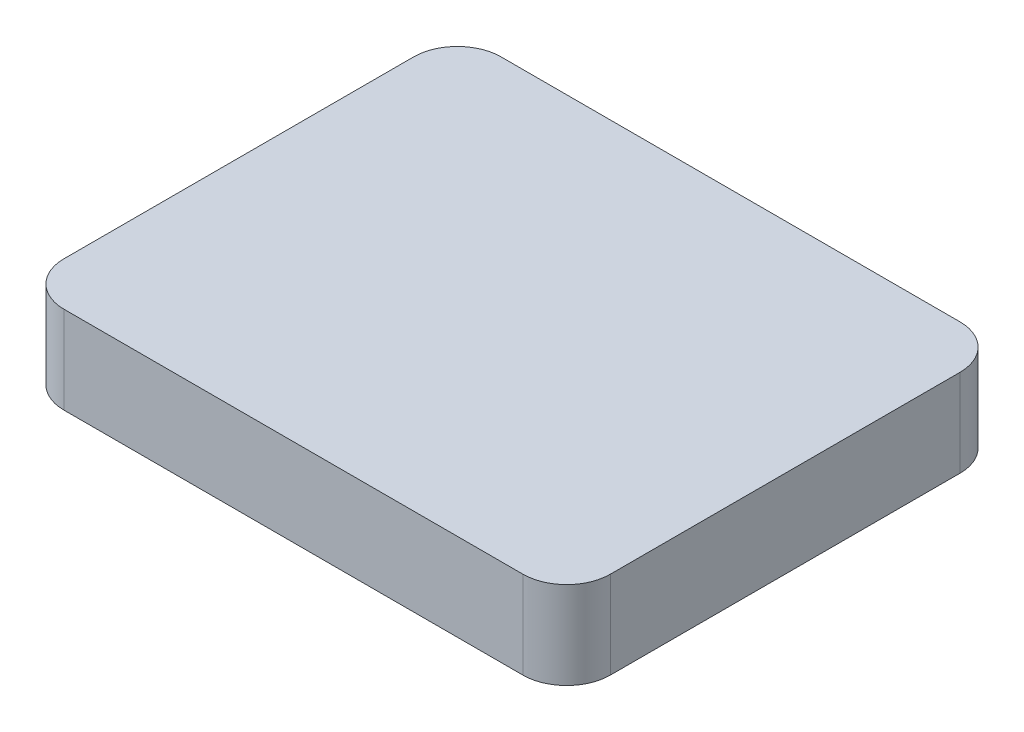
ISO-10303-21;
HEADER;
FILE_DESCRIPTION(('STEP AP214'),'2;1');
FILE_NAME('part.step','',(''),(''),'','','');
FILE_SCHEMA(('AUTOMOTIVE_DESIGN { 1 0 10303 214 1 1 1 1 }'));
ENDSEC;
DATA;
#1=APPLICATION_CONTEXT('core data for automotive mechanical design processes');
#2=APPLICATION_PROTOCOL_DEFINITION('international standard','automotive_design',2000,#1);
#3=PRODUCT_CONTEXT('',#1,'mechanical');
#4=PRODUCT('Part','Part','',(#3));
#5=PRODUCT_RELATED_PRODUCT_CATEGORY('part','',(#4));
#6=PRODUCT_DEFINITION_FORMATION('','',#4);
#7=PRODUCT_DEFINITION_CONTEXT('part definition',#1,'design');
#8=PRODUCT_DEFINITION('design','',#6,#7);
#9=PRODUCT_DEFINITION_SHAPE('','',#8);
#10=(LENGTH_UNIT() NAMED_UNIT(*) SI_UNIT(.MILLI.,.METRE.));
#11=(NAMED_UNIT(*) PLANE_ANGLE_UNIT() SI_UNIT($,.RADIAN.));
#12=(NAMED_UNIT(*) SI_UNIT($,.STERADIAN.) SOLID_ANGLE_UNIT());
#13=UNCERTAINTY_MEASURE_WITH_UNIT(LENGTH_MEASURE(1.E-05),#10,'distance_accuracy_value','');
#14=(GEOMETRIC_REPRESENTATION_CONTEXT(3) GLOBAL_UNCERTAINTY_ASSIGNED_CONTEXT((#13)) GLOBAL_UNIT_ASSIGNED_CONTEXT((#10,
#11,#12)) REPRESENTATION_CONTEXT('',''));
#15=CARTESIAN_POINT('',(0.,0.,0.));
#16=DIRECTION('',(0.,0.,1.));
#17=DIRECTION('',(1.,0.,0.));
#18=AXIS2_PLACEMENT_3D('',#15,#16,#17);
#19=CARTESIAN_POINT('',(-105.,20.,80.));
#20=DIRECTION('',(0.,-1.,0.));
#21=DIRECTION('',(0.,0.,-1.));
#22=AXIS2_PLACEMENT_3D('',#19,#20,#21);
#23=CYLINDRICAL_SURFACE('',#22,20.);
#24=CARTESIAN_POINT('',(-105.,-20.,80.));
#25=DIRECTION('',(0.,1.,0.));
#26=DIRECTION('',(0.,0.,-1.));
#27=AXIS2_PLACEMENT_3D('',#24,#25,#26);
#28=CIRCLE('',#27,20.);
#29=CARTESIAN_POINT('',(-125.,-20.,79.9999999999998));
#30=VERTEX_POINT('',#29);
#31=CARTESIAN_POINT('',(-105.,-20.,100.));
#32=VERTEX_POINT('',#31);
#33=EDGE_CURVE('E144',#30,#32,#28,.T.);
#34=ORIENTED_EDGE('',*,*,#33,.T.);
#35=DIRECTION('',(0.,-1.,0.));
#36=VECTOR('',#35,1.);
#37=CARTESIAN_POINT('',(-105.,20.,100.));
#38=LINE('',#37,#36);
#39=CARTESIAN_POINT('',(-105.,20.,100.));
#40=VERTEX_POINT('',#39);
#41=EDGE_CURVE('E11',#40,#32,#38,.T.);
#42=ORIENTED_EDGE('',*,*,#41,.F.);
#43=CARTESIAN_POINT('',(-105.,20.,80.));
#44=DIRECTION('',(0.,1.,0.));
#45=DIRECTION('',(0.,0.,-1.));
#46=AXIS2_PLACEMENT_3D('',#43,#44,#45);
#47=CIRCLE('',#46,20.);
#48=CARTESIAN_POINT('',(-125.,20.,79.9999999999998));
#49=VERTEX_POINT('',#48);
#50=EDGE_CURVE('E166',#49,#40,#47,.T.);
#51=ORIENTED_EDGE('',*,*,#50,.F.);
#52=DIRECTION('',(0.,-1.,0.));
#53=VECTOR('',#52,1.);
#54=CARTESIAN_POINT('',(-125.,20.,79.9999999999998));
#55=LINE('',#54,#53);
#56=EDGE_CURVE('E140',#49,#30,#55,.T.);
#57=ORIENTED_EDGE('',*,*,#56,.T.);
#58=EDGE_LOOP('',(#34,#42,#51,#57));
#59=FACE_BOUND('',#58,.T.);
#60=ADVANCED_FACE('F43',(#59),#23,.T.);
#61=CARTESIAN_POINT('',(-105.,20.,100.));
#62=DIRECTION('',(0.,0.,-1.));
#63=DIRECTION('',(-1.,0.,0.));
#64=AXIS2_PLACEMENT_3D('',#61,#62,#63);
#65=PLANE('',#64);
#66=DIRECTION('',(1.,0.,0.));
#67=VECTOR('',#66,1.);
#68=CARTESIAN_POINT('',(-105.,-20.,100.));
#69=LINE('',#68,#67);
#70=CARTESIAN_POINT('',(105.,-20.,100.));
#71=VERTEX_POINT('',#70);
#72=EDGE_CURVE('E148',#32,#71,#69,.T.);
#73=ORIENTED_EDGE('',*,*,#72,.T.);
#74=DIRECTION('',(0.,-1.,0.));
#75=VECTOR('',#74,1.);
#76=CARTESIAN_POINT('',(105.,20.,100.));
#77=LINE('',#76,#75);
#78=CARTESIAN_POINT('',(105.,20.,100.));
#79=VERTEX_POINT('',#78);
#80=EDGE_CURVE('E52',#79,#71,#77,.T.);
#81=ORIENTED_EDGE('',*,*,#80,.F.);
#82=DIRECTION('',(1.,0.,0.));
#83=VECTOR('',#82,1.);
#84=CARTESIAN_POINT('',(-105.,20.,100.));
#85=LINE('',#84,#83);
#86=EDGE_CURVE('E103',#40,#79,#85,.T.);
#87=ORIENTED_EDGE('',*,*,#86,.F.);
#88=ORIENTED_EDGE('',*,*,#41,.T.);
#89=EDGE_LOOP('',(#73,#81,#87,#88));
#90=FACE_BOUND('',#89,.T.);
#91=ADVANCED_FACE('F212',(#90),#65,.F.);
#92=CARTESIAN_POINT('',(105.,20.,80.));
#93=DIRECTION('',(0.,-1.,0.));
#94=DIRECTION('',(0.,0.,-1.));
#95=AXIS2_PLACEMENT_3D('',#92,#93,#94);
#96=CYLINDRICAL_SURFACE('',#95,20.);
#97=CARTESIAN_POINT('',(105.,-20.,80.));
#98=DIRECTION('',(0.,1.,0.));
#99=DIRECTION('',(0.,0.,1.));
#100=AXIS2_PLACEMENT_3D('',#97,#98,#99);
#101=CIRCLE('',#100,20.);
#102=CARTESIAN_POINT('',(125.,-20.,79.9999999999998));
#103=VERTEX_POINT('',#102);
#104=EDGE_CURVE('E151',#71,#103,#101,.T.);
#105=ORIENTED_EDGE('',*,*,#104,.T.);
#106=DIRECTION('',(0.,-1.,0.));
#107=VECTOR('',#106,1.);
#108=CARTESIAN_POINT('',(125.,20.,79.9999999999998));
#109=LINE('',#108,#107);
#110=CARTESIAN_POINT('',(125.,20.,79.9999999999998));
#111=VERTEX_POINT('',#110);
#112=EDGE_CURVE('E177',#111,#103,#109,.T.);
#113=ORIENTED_EDGE('',*,*,#112,.F.);
#114=CARTESIAN_POINT('',(105.,20.,80.));
#115=DIRECTION('',(0.,1.,0.));
#116=DIRECTION('',(0.,0.,1.));
#117=AXIS2_PLACEMENT_3D('',#114,#115,#116);
#118=CIRCLE('',#117,20.);
#119=EDGE_CURVE('E187',#79,#111,#118,.T.);
#120=ORIENTED_EDGE('',*,*,#119,.F.);
#121=ORIENTED_EDGE('',*,*,#80,.T.);
#122=EDGE_LOOP('',(#105,#113,#120,#121));
#123=FACE_BOUND('',#122,.T.);
#124=ADVANCED_FACE('F185',(#123),#96,.T.);
#125=CARTESIAN_POINT('',(125.,20.,-79.9999999999999));
#126=DIRECTION('',(-1.,0.,0.));
#127=DIRECTION('',(0.,0.,1.));
#128=AXIS2_PLACEMENT_3D('',#125,#126,#127);
#129=PLANE('',#128);
#130=DIRECTION('',(0.,0.,-1.));
#131=VECTOR('',#130,1.);
#132=CARTESIAN_POINT('',(125.,-20.,-79.9999999999999));
#133=LINE('',#132,#131);
#134=CARTESIAN_POINT('',(125.,-20.,-79.9999999999999));
#135=VERTEX_POINT('',#134);
#136=EDGE_CURVE('E154',#103,#135,#133,.T.);
#137=ORIENTED_EDGE('',*,*,#136,.T.);
#138=DIRECTION('',(0.,-1.,0.));
#139=VECTOR('',#138,1.);
#140=CARTESIAN_POINT('',(125.,20.,-79.9999999999999));
#141=LINE('',#140,#139);
#142=CARTESIAN_POINT('',(125.,20.,-79.9999999999999));
#143=VERTEX_POINT('',#142);
#144=EDGE_CURVE('E173',#143,#135,#141,.T.);
#145=ORIENTED_EDGE('',*,*,#144,.F.);
#146=DIRECTION('',(0.,0.,-1.));
#147=VECTOR('',#146,1.);
#148=CARTESIAN_POINT('',(125.,20.,-79.9999999999999));
#149=LINE('',#148,#147);
#150=EDGE_CURVE('E200',#111,#143,#149,.T.);
#151=ORIENTED_EDGE('',*,*,#150,.F.);
#152=ORIENTED_EDGE('',*,*,#112,.T.);
#153=EDGE_LOOP('',(#137,#145,#151,#152));
#154=FACE_BOUND('',#153,.T.);
#155=ADVANCED_FACE('F195',(#154),#129,.F.);
#156=CARTESIAN_POINT('',(105.,20.,-80.));
#157=DIRECTION('',(0.,-1.,0.));
#158=DIRECTION('',(0.,0.,-1.));
#159=AXIS2_PLACEMENT_3D('',#156,#157,#158);
#160=CYLINDRICAL_SURFACE('',#159,20.);
#161=CARTESIAN_POINT('',(105.,-20.,-80.));
#162=DIRECTION('',(0.,1.,0.));
#163=DIRECTION('',(0.,0.,1.));
#164=AXIS2_PLACEMENT_3D('',#161,#162,#163);
#165=CIRCLE('',#164,20.);
#166=CARTESIAN_POINT('',(105.,-20.,-100.));
#167=VERTEX_POINT('',#166);
#168=EDGE_CURVE('E157',#135,#167,#165,.T.);
#169=ORIENTED_EDGE('',*,*,#168,.T.);
#170=DIRECTION('',(0.,-1.,0.));
#171=VECTOR('',#170,1.);
#172=CARTESIAN_POINT('',(105.,20.,-100.));
#173=LINE('',#172,#171);
#174=CARTESIAN_POINT('',(105.,20.,-100.));
#175=VERTEX_POINT('',#174);
#176=EDGE_CURVE('E133',#175,#167,#173,.T.);
#177=ORIENTED_EDGE('',*,*,#176,.F.);
#178=CARTESIAN_POINT('',(105.,20.,-80.));
#179=DIRECTION('',(0.,1.,0.));
#180=DIRECTION('',(0.,0.,1.));
#181=AXIS2_PLACEMENT_3D('',#178,#179,#180);
#182=CIRCLE('',#181,20.);
#183=EDGE_CURVE('E122',#143,#175,#182,.T.);
#184=ORIENTED_EDGE('',*,*,#183,.F.);
#185=ORIENTED_EDGE('',*,*,#144,.T.);
#186=EDGE_LOOP('',(#169,#177,#184,#185));
#187=FACE_BOUND('',#186,.T.);
#188=ADVANCED_FACE('F198',(#187),#160,.T.);
#189=CARTESIAN_POINT('',(-105.,20.,-100.));
#190=DIRECTION('',(0.,0.,1.));
#191=DIRECTION('',(1.,0.,0.));
#192=AXIS2_PLACEMENT_3D('',#189,#190,#191);
#193=PLANE('',#192);
#194=DIRECTION('',(-1.,0.,0.));
#195=VECTOR('',#194,1.);
#196=CARTESIAN_POINT('',(-105.,-20.,-100.));
#197=LINE('',#196,#195);
#198=CARTESIAN_POINT('',(-105.,-20.,-100.));
#199=VERTEX_POINT('',#198);
#200=EDGE_CURVE('E131',#167,#199,#197,.T.);
#201=ORIENTED_EDGE('',*,*,#200,.T.);
#202=DIRECTION('',(0.,-1.,0.));
#203=VECTOR('',#202,1.);
#204=CARTESIAN_POINT('',(-105.,20.,-100.));
#205=LINE('',#204,#203);
#206=CARTESIAN_POINT('',(-105.,20.,-100.));
#207=VERTEX_POINT('',#206);
#208=EDGE_CURVE('E128',#207,#199,#205,.T.);
#209=ORIENTED_EDGE('',*,*,#208,.F.);
#210=DIRECTION('',(-1.,0.,0.));
#211=VECTOR('',#210,1.);
#212=CARTESIAN_POINT('',(-105.,20.,-100.));
#213=LINE('',#212,#211);
#214=EDGE_CURVE('E116',#175,#207,#213,.T.);
#215=ORIENTED_EDGE('',*,*,#214,.F.);
#216=ORIENTED_EDGE('',*,*,#176,.T.);
#217=EDGE_LOOP('',(#201,#209,#215,#216));
#218=FACE_BOUND('',#217,.T.);
#219=ADVANCED_FACE('F129',(#218),#193,.F.);
#220=CARTESIAN_POINT('',(-105.,20.,-80.));
#221=DIRECTION('',(0.,-1.,0.));
#222=DIRECTION('',(0.,0.,-1.));
#223=AXIS2_PLACEMENT_3D('',#220,#221,#222);
#224=CYLINDRICAL_SURFACE('',#223,20.);
#225=CARTESIAN_POINT('',(-105.,-20.,-80.));
#226=DIRECTION('',(0.,1.,0.));
#227=DIRECTION('',(0.,0.,-1.));
#228=AXIS2_PLACEMENT_3D('',#225,#226,#227);
#229=CIRCLE('',#228,20.);
#230=CARTESIAN_POINT('',(-125.,-20.,-79.9999999999999));
#231=VERTEX_POINT('',#230);
#232=EDGE_CURVE('E89',#199,#231,#229,.T.);
#233=ORIENTED_EDGE('',*,*,#232,.T.);
#234=DIRECTION('',(0.,-1.,0.));
#235=VECTOR('',#234,1.);
#236=CARTESIAN_POINT('',(-125.,20.,-79.9999999999999));
#237=LINE('',#236,#235);
#238=CARTESIAN_POINT('',(-125.,20.,-79.9999999999999));
#239=VERTEX_POINT('',#238);
#240=EDGE_CURVE('E134',#239,#231,#237,.T.);
#241=ORIENTED_EDGE('',*,*,#240,.F.);
#242=CARTESIAN_POINT('',(-105.,20.,-80.));
#243=DIRECTION('',(0.,1.,0.));
#244=DIRECTION('',(0.,0.,-1.));
#245=AXIS2_PLACEMENT_3D('',#242,#243,#244);
#246=CIRCLE('',#245,20.);
#247=EDGE_CURVE('E120',#207,#239,#246,.T.);
#248=ORIENTED_EDGE('',*,*,#247,.F.);
#249=ORIENTED_EDGE('',*,*,#208,.T.);
#250=EDGE_LOOP('',(#233,#241,#248,#249));
#251=FACE_BOUND('',#250,.T.);
#252=ADVANCED_FACE('F136',(#251),#224,.T.);
#253=CARTESIAN_POINT('',(-125.,20.,-79.9999999999999));
#254=DIRECTION('',(1.,0.,0.));
#255=DIRECTION('',(0.,0.,-1.));
#256=AXIS2_PLACEMENT_3D('',#253,#254,#255);
#257=PLANE('',#256);
#258=DIRECTION('',(0.,0.,1.));
#259=VECTOR('',#258,1.);
#260=CARTESIAN_POINT('',(-125.,-20.,-79.9999999999999));
#261=LINE('',#260,#259);
#262=EDGE_CURVE('E95',#231,#30,#261,.T.);
#263=ORIENTED_EDGE('',*,*,#262,.T.);
#264=ORIENTED_EDGE('',*,*,#56,.F.);
#265=DIRECTION('',(0.,0.,1.));
#266=VECTOR('',#265,1.);
#267=CARTESIAN_POINT('',(-125.,20.,-79.9999999999999));
#268=LINE('',#267,#266);
#269=EDGE_CURVE('E60',#239,#49,#268,.T.);
#270=ORIENTED_EDGE('',*,*,#269,.F.);
#271=ORIENTED_EDGE('',*,*,#240,.T.);
#272=EDGE_LOOP('',(#263,#264,#270,#271));
#273=FACE_BOUND('',#272,.T.);
#274=ADVANCED_FACE('F228',(#273),#257,.F.);
#275=CARTESIAN_POINT('',(-105.,20.,80.));
#276=DIRECTION('',(0.,-1.,0.));
#277=DIRECTION('',(0.,0.,-1.));
#278=AXIS2_PLACEMENT_3D('',#275,#276,#277);
#279=PLANE('',#278);
#280=ORIENTED_EDGE('',*,*,#50,.T.);
#281=ORIENTED_EDGE('',*,*,#86,.T.);
#282=ORIENTED_EDGE('',*,*,#119,.T.);
#283=ORIENTED_EDGE('',*,*,#150,.T.);
#284=ORIENTED_EDGE('',*,*,#183,.T.);
#285=ORIENTED_EDGE('',*,*,#214,.T.);
#286=ORIENTED_EDGE('',*,*,#247,.T.);
#287=ORIENTED_EDGE('',*,*,#269,.T.);
#288=EDGE_LOOP('',(#280,#281,#282,#283,#284,#285,#286,#287));
#289=FACE_BOUND('',#288,.T.);
#290=ADVANCED_FACE('F118',(#289),#279,.F.);
#291=CARTESIAN_POINT('',(-105.,-20.,80.));
#292=DIRECTION('',(0.,-1.,0.));
#293=DIRECTION('',(0.,0.,-1.));
#294=AXIS2_PLACEMENT_3D('',#291,#292,#293);
#295=PLANE('',#294);
#296=ORIENTED_EDGE('',*,*,#33,.F.);
#297=ORIENTED_EDGE('',*,*,#262,.F.);
#298=ORIENTED_EDGE('',*,*,#232,.F.);
#299=ORIENTED_EDGE('',*,*,#200,.F.);
#300=ORIENTED_EDGE('',*,*,#168,.F.);
#301=ORIENTED_EDGE('',*,*,#136,.F.);
#302=ORIENTED_EDGE('',*,*,#104,.F.);
#303=ORIENTED_EDGE('',*,*,#72,.F.);
#304=EDGE_LOOP('',(#296,#297,#298,#299,#300,#301,#302,#303));
#305=FACE_BOUND('',#304,.T.);
#306=ADVANCED_FACE('F191',(#305),#295,.T.);
#307=CLOSED_SHELL('',(#60,#91,#124,#155,#188,#219,#252,#274,#290,#306));
#308=MANIFOLD_SOLID_BREP('B2',#307);
#309=ADVANCED_BREP_SHAPE_REPRESENTATION('',(#18,#308),#14);
#310=SHAPE_DEFINITION_REPRESENTATION(#9,#309);
ENDSEC;
END-ISO-10303-21;
